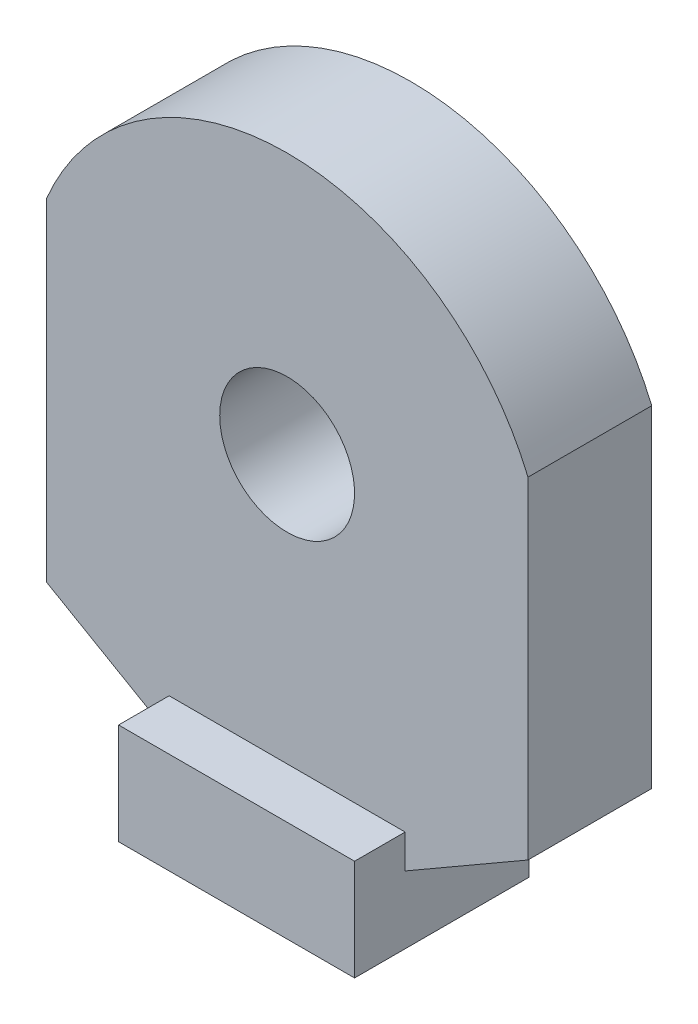
ISO-10303-21;
HEADER;
FILE_DESCRIPTION(('STEP AP214'),'2;1');
FILE_NAME('part.step','',(''),(''),'','','');
FILE_SCHEMA(('AUTOMOTIVE_DESIGN { 1 0 10303 214 1 1 1 1 }'));
ENDSEC;
DATA;
#1=APPLICATION_CONTEXT('core data for automotive mechanical design processes');
#2=APPLICATION_PROTOCOL_DEFINITION('international standard','automotive_design',2000,#1);
#3=PRODUCT_CONTEXT('',#1,'mechanical');
#4=PRODUCT('Part','Part','',(#3));
#5=PRODUCT_RELATED_PRODUCT_CATEGORY('part','',(#4));
#6=PRODUCT_DEFINITION_FORMATION('','',#4);
#7=PRODUCT_DEFINITION_CONTEXT('part definition',#1,'design');
#8=PRODUCT_DEFINITION('design','',#6,#7);
#9=PRODUCT_DEFINITION_SHAPE('','',#8);
#10=(LENGTH_UNIT() NAMED_UNIT(*) SI_UNIT(.MILLI.,.METRE.));
#11=(NAMED_UNIT(*) PLANE_ANGLE_UNIT() SI_UNIT($,.RADIAN.));
#12=(NAMED_UNIT(*) SI_UNIT($,.STERADIAN.) SOLID_ANGLE_UNIT());
#13=UNCERTAINTY_MEASURE_WITH_UNIT(LENGTH_MEASURE(1.E-05),#10,'distance_accuracy_value','');
#14=(GEOMETRIC_REPRESENTATION_CONTEXT(3) GLOBAL_UNCERTAINTY_ASSIGNED_CONTEXT((#13)) GLOBAL_UNIT_ASSIGNED_CONTEXT((#10,
#11,#12)) REPRESENTATION_CONTEXT('',''));
#15=CARTESIAN_POINT('',(0.,0.,0.));
#16=DIRECTION('',(0.,0.,1.));
#17=DIRECTION('',(1.,0.,0.));
#18=AXIS2_PLACEMENT_3D('',#15,#16,#17);
#19=CARTESIAN_POINT('',(0.,0.,7.34));
#20=DIRECTION('',(0.,0.,-1.));
#21=DIRECTION('',(-1.,0.,0.));
#22=AXIS2_PLACEMENT_3D('',#19,#20,#21);
#23=PLANE('',#22);
#24=CARTESIAN_POINT('',(0.,0.,7.34));
#25=DIRECTION('',(0.,0.,1.));
#26=DIRECTION('',(-1.,0.,0.));
#27=AXIS2_PLACEMENT_3D('',#24,#25,#26);
#28=CIRCLE('',#27,4.);
#29=CARTESIAN_POINT('',(-4.,0.,7.34));
#30=VERTEX_POINT('',#29);
#31=EDGE_CURVE('E137',#30,#30,#28,.T.);
#32=ORIENTED_EDGE('',*,*,#31,.F.);
#33=EDGE_LOOP('',(#32));
#34=FACE_BOUND('',#33,.T.);
#35=DIRECTION('',(0.,-1.,0.));
#36=VECTOR('',#35,1.);
#37=CARTESIAN_POINT('',(-7.,-21.9,7.34));
#38=LINE('',#37,#36);
#39=CARTESIAN_POINT('',(-7.,-15.9,7.34));
#40=VERTEX_POINT('',#39);
#41=CARTESIAN_POINT('',(-7.,-17.9,7.34));
#42=VERTEX_POINT('',#41);
#43=EDGE_CURVE('E49',#40,#42,#38,.T.);
#44=ORIENTED_EDGE('',*,*,#43,.F.);
#45=DIRECTION('',(-1.,0.,0.));
#46=VECTOR('',#45,1.);
#47=CARTESIAN_POINT('',(-7.,-15.9,7.34));
#48=LINE('',#47,#46);
#49=CARTESIAN_POINT('',(7.,-15.9,7.34));
#50=VERTEX_POINT('',#49);
#51=EDGE_CURVE('E165',#50,#40,#48,.T.);
#52=ORIENTED_EDGE('',*,*,#51,.F.);
#53=DIRECTION('',(0.,1.,0.));
#54=VECTOR('',#53,1.);
#55=CARTESIAN_POINT('',(7.,-21.9,7.34));
#56=LINE('',#55,#54);
#57=CARTESIAN_POINT('',(7.,-17.9,7.34));
#58=VERTEX_POINT('',#57);
#59=EDGE_CURVE('E11',#58,#50,#56,.T.);
#60=ORIENTED_EDGE('',*,*,#59,.F.);
#61=DIRECTION('',(0.866025403784436,0.500000000000004,0.));
#62=VECTOR('',#61,1.);
#63=CARTESIAN_POINT('',(14.29,-13.6911165376076,7.34));
#64=LINE('',#63,#62);
#65=CARTESIAN_POINT('',(14.29,-13.6911165376076,7.34));
#66=VERTEX_POINT('',#65);
#67=EDGE_CURVE('E149',#58,#66,#64,.T.);
#68=ORIENTED_EDGE('',*,*,#67,.T.);
#69=DIRECTION('',(0.,1.,0.));
#70=VECTOR('',#69,1.);
#71=CARTESIAN_POINT('',(14.29,-13.6911165376076,7.34));
#72=LINE('',#71,#70);
#73=CARTESIAN_POINT('',(14.29,5.97795951809647,7.34));
#74=VERTEX_POINT('',#73);
#75=EDGE_CURVE('E111',#66,#74,#72,.T.);
#76=ORIENTED_EDGE('',*,*,#75,.T.);
#77=CARTESIAN_POINT('',(0.,0.,7.34));
#78=DIRECTION('',(0.,0.,1.));
#79=DIRECTION('',(-1.,0.,0.));
#80=AXIS2_PLACEMENT_3D('',#77,#78,#79);
#81=CIRCLE('',#80,15.49);
#82=CARTESIAN_POINT('',(-14.29,5.97795951809647,7.34));
#83=VERTEX_POINT('',#82);
#84=EDGE_CURVE('E105',#74,#83,#81,.T.);
#85=ORIENTED_EDGE('',*,*,#84,.T.);
#86=DIRECTION('',(0.,-1.,0.));
#87=VECTOR('',#86,1.);
#88=CARTESIAN_POINT('',(-14.29,-13.6911165376076,7.34));
#89=LINE('',#88,#87);
#90=CARTESIAN_POINT('',(-14.29,-13.6911165376076,7.34));
#91=VERTEX_POINT('',#90);
#92=EDGE_CURVE('E108',#83,#91,#89,.T.);
#93=ORIENTED_EDGE('',*,*,#92,.T.);
#94=DIRECTION('',(0.866025403784436,-0.500000000000004,0.));
#95=VECTOR('',#94,1.);
#96=CARTESIAN_POINT('',(-14.29,-13.6911165376076,7.34));
#97=LINE('',#96,#95);
#98=EDGE_CURVE('E55',#91,#42,#97,.T.);
#99=ORIENTED_EDGE('',*,*,#98,.T.);
#100=EDGE_LOOP('',(#44,#52,#60,#68,#76,#85,#93,#99));
#101=FACE_BOUND('',#100,.T.);
#102=ADVANCED_FACE('F32',(#34,#101),#23,.F.);
#103=CARTESIAN_POINT('',(0.,0.,0.));
#104=DIRECTION('',(0.,0.,-1.));
#105=DIRECTION('',(-1.,0.,0.));
#106=AXIS2_PLACEMENT_3D('',#103,#104,#105);
#107=PLANE('',#106);
#108=DIRECTION('',(0.,1.,0.));
#109=VECTOR('',#108,1.);
#110=CARTESIAN_POINT('',(7.,-17.9,0.));
#111=LINE('',#110,#109);
#112=CARTESIAN_POINT('',(7.,-21.9,0.));
#113=VERTEX_POINT('',#112);
#114=CARTESIAN_POINT('',(7.,-17.9,0.));
#115=VERTEX_POINT('',#114);
#116=EDGE_CURVE('E133',#113,#115,#111,.T.);
#117=ORIENTED_EDGE('',*,*,#116,.F.);
#118=DIRECTION('',(1.,0.,0.));
#119=VECTOR('',#118,1.);
#120=CARTESIAN_POINT('',(-7.,-21.9,0.));
#121=LINE('',#120,#119);
#122=CARTESIAN_POINT('',(-7.,-21.9,0.));
#123=VERTEX_POINT('',#122);
#124=EDGE_CURVE('E89',#123,#113,#121,.T.);
#125=ORIENTED_EDGE('',*,*,#124,.F.);
#126=DIRECTION('',(0.,-1.,0.));
#127=VECTOR('',#126,1.);
#128=CARTESIAN_POINT('',(-7.,-17.9,0.));
#129=LINE('',#128,#127);
#130=CARTESIAN_POINT('',(-7.,-17.9,0.));
#131=VERTEX_POINT('',#130);
#132=EDGE_CURVE('E146',#131,#123,#129,.T.);
#133=ORIENTED_EDGE('',*,*,#132,.F.);
#134=DIRECTION('',(0.866025403784436,-0.500000000000004,0.));
#135=VECTOR('',#134,1.);
#136=CARTESIAN_POINT('',(-14.29,-13.6911165376076,0.));
#137=LINE('',#136,#135);
#138=CARTESIAN_POINT('',(-14.29,-13.6911165376076,0.));
#139=VERTEX_POINT('',#138);
#140=EDGE_CURVE('E144',#139,#131,#137,.T.);
#141=ORIENTED_EDGE('',*,*,#140,.F.);
#142=DIRECTION('',(0.,-1.,0.));
#143=VECTOR('',#142,1.);
#144=CARTESIAN_POINT('',(-14.29,-13.6911165376076,0.));
#145=LINE('',#144,#143);
#146=CARTESIAN_POINT('',(-14.29,5.97795951809647,0.));
#147=VERTEX_POINT('',#146);
#148=EDGE_CURVE('E142',#147,#139,#145,.T.);
#149=ORIENTED_EDGE('',*,*,#148,.F.);
#150=CARTESIAN_POINT('',(0.,0.,0.));
#151=DIRECTION('',(0.,0.,1.));
#152=DIRECTION('',(-1.,0.,0.));
#153=AXIS2_PLACEMENT_3D('',#150,#151,#152);
#154=CIRCLE('',#153,15.49);
#155=CARTESIAN_POINT('',(14.29,5.97795951809647,0.));
#156=VERTEX_POINT('',#155);
#157=EDGE_CURVE('E120',#156,#147,#154,.T.);
#158=ORIENTED_EDGE('',*,*,#157,.F.);
#159=DIRECTION('',(0.,1.,0.));
#160=VECTOR('',#159,1.);
#161=CARTESIAN_POINT('',(14.29,-13.6911165376076,0.));
#162=LINE('',#161,#160);
#163=CARTESIAN_POINT('',(14.29,-13.6911165376076,0.));
#164=VERTEX_POINT('',#163);
#165=EDGE_CURVE('E139',#164,#156,#162,.T.);
#166=ORIENTED_EDGE('',*,*,#165,.F.);
#167=DIRECTION('',(0.866025403784436,0.500000000000004,0.));
#168=VECTOR('',#167,1.);
#169=CARTESIAN_POINT('',(14.29,-13.6911165376076,0.));
#170=LINE('',#169,#168);
#171=EDGE_CURVE('E136',#115,#164,#170,.T.);
#172=ORIENTED_EDGE('',*,*,#171,.F.);
#173=EDGE_LOOP('',(#117,#125,#133,#141,#149,#158,#166,#172));
#174=FACE_BOUND('',#173,.T.);
#175=CARTESIAN_POINT('',(0.,0.,0.));
#176=DIRECTION('',(0.,0.,1.));
#177=DIRECTION('',(-1.,0.,0.));
#178=AXIS2_PLACEMENT_3D('',#175,#176,#177);
#179=CIRCLE('',#178,4.);
#180=CARTESIAN_POINT('',(-4.,0.,0.));
#181=VERTEX_POINT('',#180);
#182=EDGE_CURVE('E170',#181,#181,#179,.T.);
#183=ORIENTED_EDGE('',*,*,#182,.T.);
#184=EDGE_LOOP('',(#183));
#185=FACE_BOUND('',#184,.T.);
#186=ADVANCED_FACE('F192',(#174,#185),#107,.T.);
#187=CARTESIAN_POINT('',(7.,-17.9,7.34));
#188=DIRECTION('',(-1.,0.,0.));
#189=DIRECTION('',(0.,0.,1.));
#190=AXIS2_PLACEMENT_3D('',#187,#188,#189);
#191=PLANE('',#190);
#192=ORIENTED_EDGE('',*,*,#116,.T.);
#193=DIRECTION('',(0.,0.,-1.));
#194=VECTOR('',#193,1.);
#195=CARTESIAN_POINT('',(7.,-17.9,7.34));
#196=LINE('',#195,#194);
#197=EDGE_CURVE('E41',#58,#115,#196,.T.);
#198=ORIENTED_EDGE('',*,*,#197,.F.);
#199=ORIENTED_EDGE('',*,*,#59,.T.);
#200=DIRECTION('',(0.,0.,-1.));
#201=VECTOR('',#200,1.);
#202=CARTESIAN_POINT('',(7.,-15.9,10.34));
#203=LINE('',#202,#201);
#204=CARTESIAN_POINT('',(7.,-15.9,10.34));
#205=VERTEX_POINT('',#204);
#206=EDGE_CURVE('E166',#205,#50,#203,.T.);
#207=ORIENTED_EDGE('',*,*,#206,.F.);
#208=DIRECTION('',(0.,1.,0.));
#209=VECTOR('',#208,1.);
#210=CARTESIAN_POINT('',(7.,-21.9,10.34));
#211=LINE('',#210,#209);
#212=CARTESIAN_POINT('',(7.,-21.9,10.34));
#213=VERTEX_POINT('',#212);
#214=EDGE_CURVE('E201',#213,#205,#211,.T.);
#215=ORIENTED_EDGE('',*,*,#214,.F.);
#216=DIRECTION('',(0.,0.,-1.));
#217=VECTOR('',#216,1.);
#218=CARTESIAN_POINT('',(7.,-21.9,7.34));
#219=LINE('',#218,#217);
#220=EDGE_CURVE('E129',#213,#113,#219,.T.);
#221=ORIENTED_EDGE('',*,*,#220,.T.);
#222=EDGE_LOOP('',(#192,#198,#199,#207,#215,#221));
#223=FACE_BOUND('',#222,.T.);
#224=ADVANCED_FACE('F34',(#223),#191,.F.);
#225=CARTESIAN_POINT('',(14.29,-13.6911165376076,7.34));
#226=DIRECTION('',(-0.500000000000004,0.866025403784436,0.));
#227=DIRECTION('',(-0.866025403784436,-0.500000000000004,0.));
#228=AXIS2_PLACEMENT_3D('',#225,#226,#227);
#229=PLANE('',#228);
#230=ORIENTED_EDGE('',*,*,#171,.T.);
#231=DIRECTION('',(0.,0.,-1.));
#232=VECTOR('',#231,1.);
#233=CARTESIAN_POINT('',(14.29,-13.6911165376076,7.34));
#234=LINE('',#233,#232);
#235=EDGE_CURVE('E156',#66,#164,#234,.T.);
#236=ORIENTED_EDGE('',*,*,#235,.F.);
#237=ORIENTED_EDGE('',*,*,#67,.F.);
#238=ORIENTED_EDGE('',*,*,#197,.T.);
#239=EDGE_LOOP('',(#230,#236,#237,#238));
#240=FACE_BOUND('',#239,.T.);
#241=ADVANCED_FACE('F261',(#240),#229,.F.);
#242=CARTESIAN_POINT('',(14.29,-13.6911165376076,7.34));
#243=DIRECTION('',(-1.,0.,0.));
#244=DIRECTION('',(0.,-1.,0.));
#245=AXIS2_PLACEMENT_3D('',#242,#243,#244);
#246=PLANE('',#245);
#247=ORIENTED_EDGE('',*,*,#165,.T.);
#248=DIRECTION('',(0.,0.,-1.));
#249=VECTOR('',#248,1.);
#250=CARTESIAN_POINT('',(14.29,5.97795951809647,7.34));
#251=LINE('',#250,#249);
#252=EDGE_CURVE('E123',#74,#156,#251,.T.);
#253=ORIENTED_EDGE('',*,*,#252,.F.);
#254=ORIENTED_EDGE('',*,*,#75,.F.);
#255=ORIENTED_EDGE('',*,*,#235,.T.);
#256=EDGE_LOOP('',(#247,#253,#254,#255));
#257=FACE_BOUND('',#256,.T.);
#258=ADVANCED_FACE('F259',(#257),#246,.F.);
#259=CARTESIAN_POINT('',(0.,0.,7.34));
#260=DIRECTION('',(0.,0.,-1.));
#261=DIRECTION('',(-1.,0.,0.));
#262=AXIS2_PLACEMENT_3D('',#259,#260,#261);
#263=CYLINDRICAL_SURFACE('',#262,15.49);
#264=ORIENTED_EDGE('',*,*,#157,.T.);
#265=DIRECTION('',(0.,0.,-1.));
#266=VECTOR('',#265,1.);
#267=CARTESIAN_POINT('',(-14.29,5.97795951809647,7.34));
#268=LINE('',#267,#266);
#269=EDGE_CURVE('E117',#83,#147,#268,.T.);
#270=ORIENTED_EDGE('',*,*,#269,.F.);
#271=ORIENTED_EDGE('',*,*,#84,.F.);
#272=ORIENTED_EDGE('',*,*,#252,.T.);
#273=EDGE_LOOP('',(#264,#270,#271,#272));
#274=FACE_BOUND('',#273,.T.);
#275=ADVANCED_FACE('F118',(#274),#263,.T.);
#276=CARTESIAN_POINT('',(-14.29,-13.6911165376076,7.34));
#277=DIRECTION('',(1.,0.,0.));
#278=DIRECTION('',(0.,1.,0.));
#279=AXIS2_PLACEMENT_3D('',#276,#277,#278);
#280=PLANE('',#279);
#281=ORIENTED_EDGE('',*,*,#148,.T.);
#282=DIRECTION('',(0.,0.,-1.));
#283=VECTOR('',#282,1.);
#284=CARTESIAN_POINT('',(-14.29,-13.6911165376076,7.34));
#285=LINE('',#284,#283);
#286=EDGE_CURVE('E124',#91,#139,#285,.T.);
#287=ORIENTED_EDGE('',*,*,#286,.F.);
#288=ORIENTED_EDGE('',*,*,#92,.F.);
#289=ORIENTED_EDGE('',*,*,#269,.T.);
#290=EDGE_LOOP('',(#281,#287,#288,#289));
#291=FACE_BOUND('',#290,.T.);
#292=ADVANCED_FACE('F126',(#291),#280,.F.);
#293=CARTESIAN_POINT('',(-14.29,-13.6911165376076,7.34));
#294=DIRECTION('',(0.500000000000004,0.866025403784436,0.));
#295=DIRECTION('',(-0.866025403784436,0.500000000000004,0.));
#296=AXIS2_PLACEMENT_3D('',#293,#294,#295);
#297=PLANE('',#296);
#298=ORIENTED_EDGE('',*,*,#140,.T.);
#299=DIRECTION('',(0.,0.,-1.));
#300=VECTOR('',#299,1.);
#301=CARTESIAN_POINT('',(-7.,-17.9,7.34));
#302=LINE('',#301,#300);
#303=EDGE_CURVE('E153',#42,#131,#302,.T.);
#304=ORIENTED_EDGE('',*,*,#303,.F.);
#305=ORIENTED_EDGE('',*,*,#98,.F.);
#306=ORIENTED_EDGE('',*,*,#286,.T.);
#307=EDGE_LOOP('',(#298,#304,#305,#306));
#308=FACE_BOUND('',#307,.T.);
#309=ADVANCED_FACE('F252',(#308),#297,.F.);
#310=CARTESIAN_POINT('',(-7.,-17.9,7.34));
#311=DIRECTION('',(1.,0.,0.));
#312=DIRECTION('',(0.,0.,-1.));
#313=AXIS2_PLACEMENT_3D('',#310,#311,#312);
#314=PLANE('',#313);
#315=ORIENTED_EDGE('',*,*,#132,.T.);
#316=DIRECTION('',(0.,0.,-1.));
#317=VECTOR('',#316,1.);
#318=CARTESIAN_POINT('',(-7.,-21.9,7.34));
#319=LINE('',#318,#317);
#320=CARTESIAN_POINT('',(-7.,-21.9,10.34));
#321=VERTEX_POINT('',#320);
#322=EDGE_CURVE('E151',#321,#123,#319,.T.);
#323=ORIENTED_EDGE('',*,*,#322,.F.);
#324=DIRECTION('',(0.,-1.,0.));
#325=VECTOR('',#324,1.);
#326=CARTESIAN_POINT('',(-7.,-21.9,10.34));
#327=LINE('',#326,#325);
#328=CARTESIAN_POINT('',(-7.,-15.9,10.34));
#329=VERTEX_POINT('',#328);
#330=EDGE_CURVE('E214',#329,#321,#327,.T.);
#331=ORIENTED_EDGE('',*,*,#330,.F.);
#332=DIRECTION('',(0.,0.,-1.));
#333=VECTOR('',#332,1.);
#334=CARTESIAN_POINT('',(-7.,-15.9,10.34));
#335=LINE('',#334,#333);
#336=EDGE_CURVE('E221',#329,#40,#335,.T.);
#337=ORIENTED_EDGE('',*,*,#336,.T.);
#338=ORIENTED_EDGE('',*,*,#43,.T.);
#339=ORIENTED_EDGE('',*,*,#303,.T.);
#340=EDGE_LOOP('',(#315,#323,#331,#337,#338,#339));
#341=FACE_BOUND('',#340,.T.);
#342=ADVANCED_FACE('F185',(#341),#314,.F.);
#343=CARTESIAN_POINT('',(-7.,-21.9,7.34));
#344=DIRECTION('',(0.,1.,0.));
#345=DIRECTION('',(0.,0.,1.));
#346=AXIS2_PLACEMENT_3D('',#343,#344,#345);
#347=PLANE('',#346);
#348=ORIENTED_EDGE('',*,*,#124,.T.);
#349=ORIENTED_EDGE('',*,*,#220,.F.);
#350=DIRECTION('',(1.,0.,0.));
#351=VECTOR('',#350,1.);
#352=CARTESIAN_POINT('',(-7.,-21.9,10.34));
#353=LINE('',#352,#351);
#354=EDGE_CURVE('E206',#321,#213,#353,.T.);
#355=ORIENTED_EDGE('',*,*,#354,.F.);
#356=ORIENTED_EDGE('',*,*,#322,.T.);
#357=EDGE_LOOP('',(#348,#349,#355,#356));
#358=FACE_BOUND('',#357,.T.);
#359=ADVANCED_FACE('F204',(#358),#347,.F.);
#360=CARTESIAN_POINT('',(0.,0.,7.34));
#361=DIRECTION('',(0.,0.,-1.));
#362=DIRECTION('',(-1.,0.,0.));
#363=AXIS2_PLACEMENT_3D('',#360,#361,#362);
#364=CYLINDRICAL_SURFACE('',#363,4.);
#365=ORIENTED_EDGE('',*,*,#31,.T.);
#366=EDGE_LOOP('',(#365));
#367=FACE_BOUND('',#366,.T.);
#368=ORIENTED_EDGE('',*,*,#182,.F.);
#369=EDGE_LOOP('',(#368));
#370=FACE_BOUND('',#369,.T.);
#371=ADVANCED_FACE('F230',(#367,#370),#364,.F.);
#372=CARTESIAN_POINT('',(-7.,-15.9,10.34));
#373=DIRECTION('',(0.,-1.,0.));
#374=DIRECTION('',(0.,0.,-1.));
#375=AXIS2_PLACEMENT_3D('',#372,#373,#374);
#376=PLANE('',#375);
#377=ORIENTED_EDGE('',*,*,#51,.T.);
#378=ORIENTED_EDGE('',*,*,#336,.F.);
#379=DIRECTION('',(-1.,0.,0.));
#380=VECTOR('',#379,1.);
#381=CARTESIAN_POINT('',(-7.,-15.9,10.34));
#382=LINE('',#381,#380);
#383=EDGE_CURVE('E216',#205,#329,#382,.T.);
#384=ORIENTED_EDGE('',*,*,#383,.F.);
#385=ORIENTED_EDGE('',*,*,#206,.T.);
#386=EDGE_LOOP('',(#377,#378,#384,#385));
#387=FACE_BOUND('',#386,.T.);
#388=ADVANCED_FACE('F226',(#387),#376,.F.);
#389=CARTESIAN_POINT('',(0.,0.,10.34));
#390=DIRECTION('',(0.,0.,-1.));
#391=DIRECTION('',(-1.,0.,0.));
#392=AXIS2_PLACEMENT_3D('',#389,#390,#391);
#393=PLANE('',#392);
#394=ORIENTED_EDGE('',*,*,#330,.T.);
#395=ORIENTED_EDGE('',*,*,#354,.T.);
#396=ORIENTED_EDGE('',*,*,#214,.T.);
#397=ORIENTED_EDGE('',*,*,#383,.T.);
#398=EDGE_LOOP('',(#394,#395,#396,#397));
#399=FACE_BOUND('',#398,.T.);
#400=ADVANCED_FACE('F211',(#399),#393,.F.);
#401=CLOSED_SHELL('',(#102,#186,#224,#241,#258,#275,#292,#309,#342,#359,#371,#388,#400));
#402=MANIFOLD_SOLID_BREP('B2',#401);
#403=ADVANCED_BREP_SHAPE_REPRESENTATION('',(#18,#402),#14);
#404=SHAPE_DEFINITION_REPRESENTATION(#9,#403);
ENDSEC;
END-ISO-10303-21;
